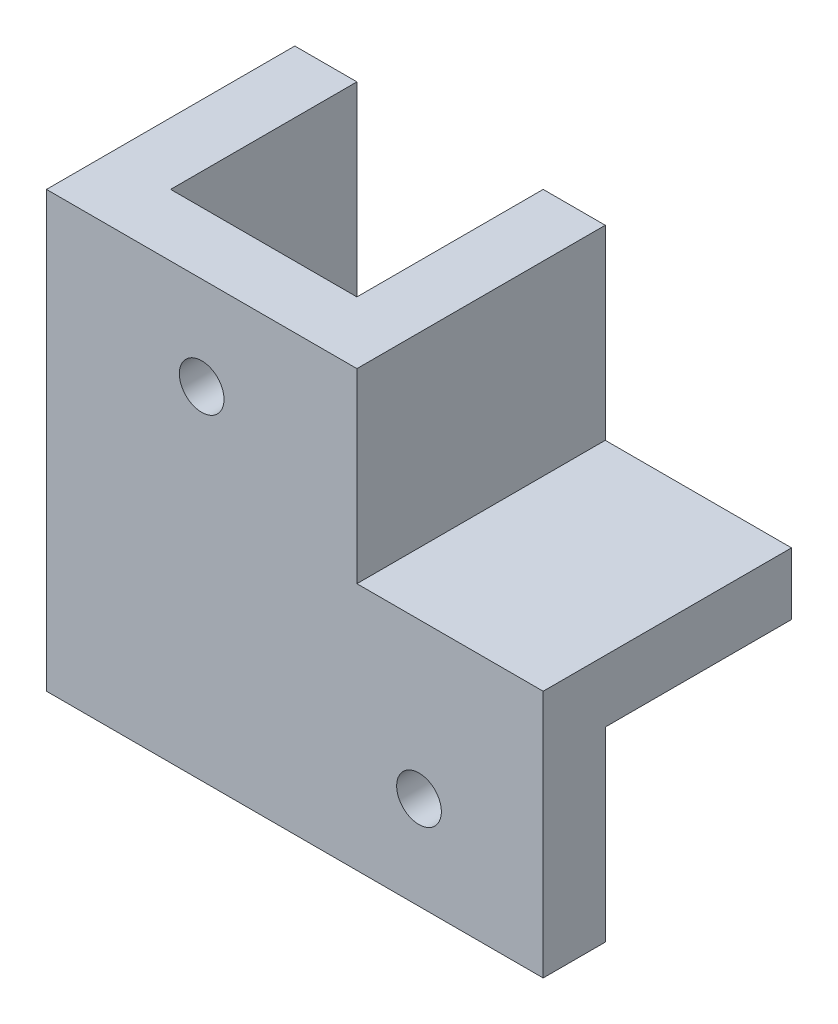
ISO-10303-21;
HEADER;
FILE_DESCRIPTION(('STEP AP214'),'2;1');
FILE_NAME('part.step','',(''),(''),'','','');
FILE_SCHEMA(('AUTOMOTIVE_DESIGN { 1 0 10303 214 1 1 1 1 }'));
ENDSEC;
DATA;
#1=APPLICATION_CONTEXT('core data for automotive mechanical design processes');
#2=APPLICATION_PROTOCOL_DEFINITION('international standard','automotive_design',2000,#1);
#3=PRODUCT_CONTEXT('',#1,'mechanical');
#4=PRODUCT('Part','Part','',(#3));
#5=PRODUCT_RELATED_PRODUCT_CATEGORY('part','',(#4));
#6=PRODUCT_DEFINITION_FORMATION('','',#4);
#7=PRODUCT_DEFINITION_CONTEXT('part definition',#1,'design');
#8=PRODUCT_DEFINITION('design','',#6,#7);
#9=PRODUCT_DEFINITION_SHAPE('','',#8);
#10=(LENGTH_UNIT() NAMED_UNIT(*) SI_UNIT(.MILLI.,.METRE.));
#11=(NAMED_UNIT(*) PLANE_ANGLE_UNIT() SI_UNIT($,.RADIAN.));
#12=(NAMED_UNIT(*) SI_UNIT($,.STERADIAN.) SOLID_ANGLE_UNIT());
#13=UNCERTAINTY_MEASURE_WITH_UNIT(LENGTH_MEASURE(1.E-05),#10,'distance_accuracy_value','');
#14=(GEOMETRIC_REPRESENTATION_CONTEXT(3) GLOBAL_UNCERTAINTY_ASSIGNED_CONTEXT((#13)) GLOBAL_UNIT_ASSIGNED_CONTEXT((#10,
#11,#12)) REPRESENTATION_CONTEXT('',''));
#15=CARTESIAN_POINT('',(0.,0.,0.));
#16=DIRECTION('',(0.,0.,1.));
#17=DIRECTION('',(1.,0.,0.));
#18=AXIS2_PLACEMENT_3D('',#15,#16,#17);
#19=CARTESIAN_POINT('',(7.47011952191236,-10.8067729083665,-15.));
#20=DIRECTION('',(1.,0.,0.));
#21=DIRECTION('',(0.,1.,0.));
#22=AXIS2_PLACEMENT_3D('',#19,#20,#21);
#23=PLANE('',#22);
#24=DIRECTION('',(0.,1.,0.));
#25=VECTOR('',#24,1.);
#26=CARTESIAN_POINT('',(7.47011952191236,9.19322709163348,0.));
#27=LINE('',#26,#25);
#28=CARTESIAN_POINT('',(7.47011952191236,-10.8067729083665,0.));
#29=VERTEX_POINT('',#28);
#30=CARTESIAN_POINT('',(7.47011952191236,9.19322709163348,0.));
#31=VERTEX_POINT('',#30);
#32=EDGE_CURVE('E164',#29,#31,#27,.T.);
#33=ORIENTED_EDGE('',*,*,#32,.T.);
#34=DIRECTION('',(0.,0.,1.));
#35=VECTOR('',#34,1.);
#36=CARTESIAN_POINT('',(7.47011952191236,9.19322709163348,-15.));
#37=LINE('',#36,#35);
#38=CARTESIAN_POINT('',(7.47011952191236,9.19322709163348,-15.));
#39=VERTEX_POINT('',#38);
#40=EDGE_CURVE('E11',#39,#31,#37,.T.);
#41=ORIENTED_EDGE('',*,*,#40,.F.);
#42=DIRECTION('',(0.,1.,0.));
#43=VECTOR('',#42,1.);
#44=CARTESIAN_POINT('',(7.47011952191236,-10.8067729083665,-15.));
#45=LINE('',#44,#43);
#46=CARTESIAN_POINT('',(7.47011952191236,-10.8067729083665,-15.));
#47=VERTEX_POINT('',#46);
#48=EDGE_CURVE('E182',#47,#39,#45,.T.);
#49=ORIENTED_EDGE('',*,*,#48,.F.);
#50=DIRECTION('',(0.,0.,1.));
#51=VECTOR('',#50,1.);
#52=CARTESIAN_POINT('',(7.47011952191236,-10.8067729083665,-15.));
#53=LINE('',#52,#51);
#54=EDGE_CURVE('E192',#47,#29,#53,.T.);
#55=ORIENTED_EDGE('',*,*,#54,.T.);
#56=EDGE_LOOP('',(#33,#41,#49,#55));
#57=FACE_BOUND('',#56,.T.);
#58=ADVANCED_FACE('F35',(#57),#23,.F.);
#59=CARTESIAN_POINT('',(27.4701195219124,-10.8067729083665,-15.));
#60=DIRECTION('',(0.,1.,0.));
#61=DIRECTION('',(-1.,0.,0.));
#62=AXIS2_PLACEMENT_3D('',#59,#60,#61);
#63=PLANE('',#62);
#64=DIRECTION('',(-1.,0.,0.));
#65=VECTOR('',#64,1.);
#66=CARTESIAN_POINT('',(27.4701195219124,-10.8067729083665,0.));
#67=LINE('',#66,#65);
#68=CARTESIAN_POINT('',(27.4701195219124,-10.8067729083665,0.));
#69=VERTEX_POINT('',#68);
#70=EDGE_CURVE('E161',#69,#29,#67,.T.);
#71=ORIENTED_EDGE('',*,*,#70,.T.);
#72=ORIENTED_EDGE('',*,*,#54,.F.);
#73=DIRECTION('',(-1.,0.,0.));
#74=VECTOR('',#73,1.);
#75=CARTESIAN_POINT('',(27.4701195219124,-10.8067729083665,-15.));
#76=LINE('',#75,#74);
#77=CARTESIAN_POINT('',(27.4701195219124,-10.8067729083665,-15.));
#78=VERTEX_POINT('',#77);
#79=EDGE_CURVE('E49',#78,#47,#76,.T.);
#80=ORIENTED_EDGE('',*,*,#79,.F.);
#81=DIRECTION('',(0.,0.,1.));
#82=VECTOR('',#81,1.);
#83=CARTESIAN_POINT('',(27.4701195219124,-10.8067729083665,-15.));
#84=LINE('',#83,#82);
#85=EDGE_CURVE('E195',#78,#69,#84,.T.);
#86=ORIENTED_EDGE('',*,*,#85,.T.);
#87=EDGE_LOOP('',(#71,#72,#80,#86));
#88=FACE_BOUND('',#87,.T.);
#89=ADVANCED_FACE('F225',(#88),#63,.F.);
#90=CARTESIAN_POINT('',(7.47011952191236,9.19322709163348,-15.));
#91=DIRECTION('',(0.,-1.,0.));
#92=DIRECTION('',(0.,0.,-1.));
#93=AXIS2_PLACEMENT_3D('',#90,#91,#92);
#94=PLANE('',#93);
#95=ORIENTED_EDGE('',*,*,#40,.T.);
#96=DIRECTION('',(-1.,0.,0.));
#97=VECTOR('',#96,1.);
#98=CARTESIAN_POINT('',(-7.52988047808764,9.19322709163348,0.));
#99=LINE('',#98,#97);
#100=CARTESIAN_POINT('',(-7.52988047808764,9.19322709163348,0.));
#101=VERTEX_POINT('',#100);
#102=EDGE_CURVE('E157',#31,#101,#99,.T.);
#103=ORIENTED_EDGE('',*,*,#102,.T.);
#104=DIRECTION('',(0.,0.,1.));
#105=VECTOR('',#104,1.);
#106=CARTESIAN_POINT('',(-7.52988047808764,9.19322709163348,-15.));
#107=LINE('',#106,#105);
#108=CARTESIAN_POINT('',(-7.52988047808764,9.19322709163348,-15.));
#109=VERTEX_POINT('',#108);
#110=EDGE_CURVE('E142',#109,#101,#107,.T.);
#111=ORIENTED_EDGE('',*,*,#110,.F.);
#112=DIRECTION('',(1.,0.,0.));
#113=VECTOR('',#112,1.);
#114=CARTESIAN_POINT('',(-7.52988047808764,9.19322709163348,-15.));
#115=LINE('',#114,#113);
#116=CARTESIAN_POINT('',(-12.5298804780876,9.19322709163348,-15.));
#117=VERTEX_POINT('',#116);
#118=EDGE_CURVE('E134',#117,#109,#115,.T.);
#119=ORIENTED_EDGE('',*,*,#118,.F.);
#120=DIRECTION('',(0.,0.,-1.));
#121=VECTOR('',#120,1.);
#122=CARTESIAN_POINT('',(-12.5298804780876,9.19322709163348,5.));
#123=LINE('',#122,#121);
#124=CARTESIAN_POINT('',(-12.5298804780876,9.19322709163348,5.));
#125=VERTEX_POINT('',#124);
#126=EDGE_CURVE('E145',#125,#117,#123,.T.);
#127=ORIENTED_EDGE('',*,*,#126,.F.);
#128=DIRECTION('',(-1.,0.,0.));
#129=VECTOR('',#128,1.);
#130=CARTESIAN_POINT('',(12.4701195219124,9.19322709163348,5.));
#131=LINE('',#130,#129);
#132=CARTESIAN_POINT('',(12.4701195219124,9.19322709163348,5.));
#133=VERTEX_POINT('',#132);
#134=EDGE_CURVE('E171',#133,#125,#131,.T.);
#135=ORIENTED_EDGE('',*,*,#134,.F.);
#136=DIRECTION('',(0.,0.,1.));
#137=VECTOR('',#136,1.);
#138=CARTESIAN_POINT('',(12.4701195219124,9.19322709163348,-15.));
#139=LINE('',#138,#137);
#140=CARTESIAN_POINT('',(12.4701195219124,9.19322709163348,-15.));
#141=VERTEX_POINT('',#140);
#142=EDGE_CURVE('E42',#141,#133,#139,.T.);
#143=ORIENTED_EDGE('',*,*,#142,.F.);
#144=DIRECTION('',(1.,0.,0.));
#145=VECTOR('',#144,1.);
#146=CARTESIAN_POINT('',(7.47011952191236,9.19322709163348,-15.));
#147=LINE('',#146,#145);
#148=EDGE_CURVE('E184',#39,#141,#147,.T.);
#149=ORIENTED_EDGE('',*,*,#148,.F.);
#150=EDGE_LOOP('',(#95,#103,#111,#119,#127,#135,#143,#149));
#151=FACE_BOUND('',#150,.T.);
#152=ADVANCED_FACE('F213',(#151),#94,.F.);
#153=CARTESIAN_POINT('',(12.4701195219124,9.19322709163348,-15.));
#154=DIRECTION('',(-1.,0.,0.));
#155=DIRECTION('',(0.,-1.,0.));
#156=AXIS2_PLACEMENT_3D('',#153,#154,#155);
#157=PLANE('',#156);
#158=ORIENTED_EDGE('',*,*,#142,.T.);
#159=DIRECTION('',(0.,1.,0.));
#160=VECTOR('',#159,1.);
#161=CARTESIAN_POINT('',(12.4701195219124,-5.80677290836653,5.));
#162=LINE('',#161,#160);
#163=CARTESIAN_POINT('',(12.4701195219124,-5.80677290836653,5.));
#164=VERTEX_POINT('',#163);
#165=EDGE_CURVE('E179',#164,#133,#162,.T.);
#166=ORIENTED_EDGE('',*,*,#165,.F.);
#167=DIRECTION('',(0.,0.,1.));
#168=VECTOR('',#167,1.);
#169=CARTESIAN_POINT('',(12.4701195219124,-5.80677290836653,-15.));
#170=LINE('',#169,#168);
#171=CARTESIAN_POINT('',(12.4701195219124,-5.80677290836653,-15.));
#172=VERTEX_POINT('',#171);
#173=EDGE_CURVE('E200',#172,#164,#170,.T.);
#174=ORIENTED_EDGE('',*,*,#173,.F.);
#175=DIRECTION('',(0.,-1.,0.));
#176=VECTOR('',#175,1.);
#177=CARTESIAN_POINT('',(12.4701195219124,9.19322709163348,-15.));
#178=LINE('',#177,#176);
#179=EDGE_CURVE('E186',#141,#172,#178,.T.);
#180=ORIENTED_EDGE('',*,*,#179,.F.);
#181=EDGE_LOOP('',(#158,#166,#174,#180));
#182=FACE_BOUND('',#181,.T.);
#183=ADVANCED_FACE('F205',(#182),#157,.F.);
#184=CARTESIAN_POINT('',(12.4701195219124,-5.80677290836653,-15.));
#185=DIRECTION('',(0.,-1.,0.));
#186=DIRECTION('',(1.,0.,0.));
#187=AXIS2_PLACEMENT_3D('',#184,#185,#186);
#188=PLANE('',#187);
#189=ORIENTED_EDGE('',*,*,#173,.T.);
#190=DIRECTION('',(-1.,0.,0.));
#191=VECTOR('',#190,1.);
#192=CARTESIAN_POINT('',(27.4701195219124,-5.80677290836653,5.));
#193=LINE('',#192,#191);
#194=CARTESIAN_POINT('',(27.4701195219124,-5.80677290836653,5.));
#195=VERTEX_POINT('',#194);
#196=EDGE_CURVE('E176',#195,#164,#193,.T.);
#197=ORIENTED_EDGE('',*,*,#196,.F.);
#198=DIRECTION('',(0.,0.,1.));
#199=VECTOR('',#198,1.);
#200=CARTESIAN_POINT('',(27.4701195219124,-5.80677290836653,-15.));
#201=LINE('',#200,#199);
#202=CARTESIAN_POINT('',(27.4701195219124,-5.80677290836653,-15.));
#203=VERTEX_POINT('',#202);
#204=EDGE_CURVE('E198',#203,#195,#201,.T.);
#205=ORIENTED_EDGE('',*,*,#204,.F.);
#206=DIRECTION('',(1.,0.,0.));
#207=VECTOR('',#206,1.);
#208=CARTESIAN_POINT('',(12.4701195219124,-5.80677290836653,-15.));
#209=LINE('',#208,#207);
#210=EDGE_CURVE('E188',#172,#203,#209,.T.);
#211=ORIENTED_EDGE('',*,*,#210,.F.);
#212=EDGE_LOOP('',(#189,#197,#205,#211));
#213=FACE_BOUND('',#212,.T.);
#214=ADVANCED_FACE('F229',(#213),#188,.F.);
#215=CARTESIAN_POINT('',(27.4701195219124,-10.8067729083665,-15.));
#216=DIRECTION('',(-1.,0.,0.));
#217=DIRECTION('',(0.,0.,1.));
#218=AXIS2_PLACEMENT_3D('',#215,#216,#217);
#219=PLANE('',#218);
#220=ORIENTED_EDGE('',*,*,#204,.T.);
#221=DIRECTION('',(0.,1.,0.));
#222=VECTOR('',#221,1.);
#223=CARTESIAN_POINT('',(27.4701195219124,-10.8067729083665,5.));
#224=LINE('',#223,#222);
#225=CARTESIAN_POINT('',(27.4701195219124,-25.8067729083665,5.));
#226=VERTEX_POINT('',#225);
#227=EDGE_CURVE('E173',#226,#195,#224,.T.);
#228=ORIENTED_EDGE('',*,*,#227,.F.);
#229=DIRECTION('',(0.,0.,-1.));
#230=VECTOR('',#229,1.);
#231=CARTESIAN_POINT('',(27.4701195219124,-25.8067729083665,5.));
#232=LINE('',#231,#230);
#233=CARTESIAN_POINT('',(27.4701195219124,-25.8067729083665,0.));
#234=VERTEX_POINT('',#233);
#235=EDGE_CURVE('E156',#226,#234,#232,.T.);
#236=ORIENTED_EDGE('',*,*,#235,.T.);
#237=DIRECTION('',(0.,1.,0.));
#238=VECTOR('',#237,1.);
#239=CARTESIAN_POINT('',(27.4701195219124,-25.8067729083665,0.));
#240=LINE('',#239,#238);
#241=EDGE_CURVE('E159',#234,#69,#240,.T.);
#242=ORIENTED_EDGE('',*,*,#241,.T.);
#243=ORIENTED_EDGE('',*,*,#85,.F.);
#244=DIRECTION('',(0.,-1.,0.));
#245=VECTOR('',#244,1.);
#246=CARTESIAN_POINT('',(27.4701195219124,-10.8067729083665,-15.));
#247=LINE('',#246,#245);
#248=EDGE_CURVE('E54',#203,#78,#247,.T.);
#249=ORIENTED_EDGE('',*,*,#248,.F.);
#250=EDGE_LOOP('',(#220,#228,#236,#242,#243,#249));
#251=FACE_BOUND('',#250,.T.);
#252=ADVANCED_FACE('F220',(#251),#219,.F.);
#253=CARTESIAN_POINT('',(0.,0.,-15.));
#254=DIRECTION('',(0.,0.,-1.));
#255=DIRECTION('',(-1.,0.,0.));
#256=AXIS2_PLACEMENT_3D('',#253,#254,#255);
#257=PLANE('',#256);
#258=ORIENTED_EDGE('',*,*,#48,.T.);
#259=ORIENTED_EDGE('',*,*,#148,.T.);
#260=ORIENTED_EDGE('',*,*,#179,.T.);
#261=ORIENTED_EDGE('',*,*,#210,.T.);
#262=ORIENTED_EDGE('',*,*,#248,.T.);
#263=ORIENTED_EDGE('',*,*,#79,.T.);
#264=EDGE_LOOP('',(#258,#259,#260,#261,#262,#263));
#265=FACE_BOUND('',#264,.T.);
#266=ADVANCED_FACE('F230',(#265),#257,.T.);
#267=CARTESIAN_POINT('',(0.,0.,5.));
#268=DIRECTION('',(0.,0.,1.));
#269=DIRECTION('',(1.,0.,0.));
#270=AXIS2_PLACEMENT_3D('',#267,#268,#269);
#271=PLANE('',#270);
#272=CARTESIAN_POINT('',(-0.0298804780876445,1.69322709163348,5.));
#273=DIRECTION('',(0.,0.,-1.));
#274=DIRECTION('',(-1.,0.,0.));
#275=AXIS2_PLACEMENT_3D('',#272,#273,#274);
#276=CIRCLE('',#275,1.8);
#277=CARTESIAN_POINT('',(-1.82988047808764,1.69322709163348,5.));
#278=VERTEX_POINT('',#277);
#279=EDGE_CURVE('E409',#278,#278,#276,.T.);
#280=ORIENTED_EDGE('',*,*,#279,.T.);
#281=EDGE_LOOP('',(#280));
#282=FACE_BOUND('',#281,.T.);
#283=CARTESIAN_POINT('',(17.4701195219124,-18.3067729083665,5.));
#284=DIRECTION('',(0.,0.,-1.));
#285=DIRECTION('',(-1.,0.,0.));
#286=AXIS2_PLACEMENT_3D('',#283,#284,#285);
#287=CIRCLE('',#286,1.8);
#288=CARTESIAN_POINT('',(15.6701195219124,-18.3067729083665,5.));
#289=VERTEX_POINT('',#288);
#290=EDGE_CURVE('E413',#289,#289,#287,.T.);
#291=ORIENTED_EDGE('',*,*,#290,.T.);
#292=EDGE_LOOP('',(#291));
#293=FACE_BOUND('',#292,.T.);
#294=DIRECTION('',(1.,0.,0.));
#295=VECTOR('',#294,1.);
#296=CARTESIAN_POINT('',(-7.52988047808764,-25.8067729083665,5.));
#297=LINE('',#296,#295);
#298=CARTESIAN_POINT('',(-12.5298804780876,-25.8067729083665,5.));
#299=VERTEX_POINT('',#298);
#300=EDGE_CURVE('E153',#299,#226,#297,.T.);
#301=ORIENTED_EDGE('',*,*,#300,.T.);
#302=ORIENTED_EDGE('',*,*,#227,.T.);
#303=ORIENTED_EDGE('',*,*,#196,.T.);
#304=ORIENTED_EDGE('',*,*,#165,.T.);
#305=ORIENTED_EDGE('',*,*,#134,.T.);
#306=DIRECTION('',(0.,-1.,0.));
#307=VECTOR('',#306,1.);
#308=CARTESIAN_POINT('',(-12.5298804780876,9.19322709163348,5.));
#309=LINE('',#308,#307);
#310=EDGE_CURVE('E141',#125,#299,#309,.T.);
#311=ORIENTED_EDGE('',*,*,#310,.T.);
#312=EDGE_LOOP('',(#301,#302,#303,#304,#305,#311));
#313=FACE_BOUND('',#312,.T.);
#314=ADVANCED_FACE('F210',(#282,#293,#313),#271,.T.);
#315=CARTESIAN_POINT('',(0.,0.,0.));
#316=DIRECTION('',(0.,0.,1.));
#317=DIRECTION('',(1.,0.,0.));
#318=AXIS2_PLACEMENT_3D('',#315,#316,#317);
#319=PLANE('',#318);
#320=CARTESIAN_POINT('',(-0.0298804780876445,1.69322709163348,0.));
#321=DIRECTION('',(0.,0.,-1.));
#322=DIRECTION('',(-1.,0.,0.));
#323=AXIS2_PLACEMENT_3D('',#320,#321,#322);
#324=CIRCLE('',#323,1.8);
#325=CARTESIAN_POINT('',(-1.82988047808764,1.69322709163348,0.));
#326=VERTEX_POINT('',#325);
#327=EDGE_CURVE('E412',#326,#326,#324,.T.);
#328=ORIENTED_EDGE('',*,*,#327,.F.);
#329=EDGE_LOOP('',(#328));
#330=FACE_BOUND('',#329,.T.);
#331=CARTESIAN_POINT('',(17.4701195219124,-18.3067729083665,0.));
#332=DIRECTION('',(0.,0.,-1.));
#333=DIRECTION('',(-1.,0.,0.));
#334=AXIS2_PLACEMENT_3D('',#331,#332,#333);
#335=CIRCLE('',#334,1.8);
#336=CARTESIAN_POINT('',(15.6701195219124,-18.3067729083665,0.));
#337=VERTEX_POINT('',#336);
#338=EDGE_CURVE('E417',#337,#337,#335,.T.);
#339=ORIENTED_EDGE('',*,*,#338,.F.);
#340=EDGE_LOOP('',(#339));
#341=FACE_BOUND('',#340,.T.);
#342=DIRECTION('',(0.,-1.,0.));
#343=VECTOR('',#342,1.);
#344=CARTESIAN_POINT('',(-7.52988047808764,-25.8067729083665,0.));
#345=LINE('',#344,#343);
#346=CARTESIAN_POINT('',(-7.52988047808764,-25.8067729083665,0.));
#347=VERTEX_POINT('',#346);
#348=EDGE_CURVE('E138',#101,#347,#345,.T.);
#349=ORIENTED_EDGE('',*,*,#348,.F.);
#350=ORIENTED_EDGE('',*,*,#102,.F.);
#351=ORIENTED_EDGE('',*,*,#32,.F.);
#352=ORIENTED_EDGE('',*,*,#70,.F.);
#353=ORIENTED_EDGE('',*,*,#241,.F.);
#354=DIRECTION('',(1.,0.,0.));
#355=VECTOR('',#354,1.);
#356=CARTESIAN_POINT('',(-7.52988047808764,-25.8067729083665,0.));
#357=LINE('',#356,#355);
#358=EDGE_CURVE('E152',#347,#234,#357,.T.);
#359=ORIENTED_EDGE('',*,*,#358,.F.);
#360=EDGE_LOOP('',(#349,#350,#351,#352,#353,#359));
#361=FACE_BOUND('',#360,.T.);
#362=ADVANCED_FACE('F223',(#330,#341,#361),#319,.F.);
#363=CARTESIAN_POINT('',(-7.52988047808764,-25.8067729083665,5.));
#364=DIRECTION('',(0.,1.,0.));
#365=DIRECTION('',(0.,0.,1.));
#366=AXIS2_PLACEMENT_3D('',#363,#364,#365);
#367=PLANE('',#366);
#368=DIRECTION('',(0.,0.,-1.));
#369=VECTOR('',#368,1.);
#370=CARTESIAN_POINT('',(-12.5298804780876,-25.8067729083665,5.));
#371=LINE('',#370,#369);
#372=CARTESIAN_POINT('',(-12.5298804780876,-25.8067729083665,-15.));
#373=VERTEX_POINT('',#372);
#374=EDGE_CURVE('E124',#299,#373,#371,.T.);
#375=ORIENTED_EDGE('',*,*,#374,.T.);
#376=DIRECTION('',(-1.,0.,0.));
#377=VECTOR('',#376,1.);
#378=CARTESIAN_POINT('',(-7.52988047808764,-25.8067729083665,-15.));
#379=LINE('',#378,#377);
#380=CARTESIAN_POINT('',(-7.52988047808764,-25.8067729083665,-15.));
#381=VERTEX_POINT('',#380);
#382=EDGE_CURVE('E117',#381,#373,#379,.T.);
#383=ORIENTED_EDGE('',*,*,#382,.F.);
#384=DIRECTION('',(0.,0.,1.));
#385=VECTOR('',#384,1.);
#386=CARTESIAN_POINT('',(-7.52988047808764,-25.8067729083665,-15.));
#387=LINE('',#386,#385);
#388=EDGE_CURVE('E121',#381,#347,#387,.T.);
#389=ORIENTED_EDGE('',*,*,#388,.T.);
#390=ORIENTED_EDGE('',*,*,#358,.T.);
#391=ORIENTED_EDGE('',*,*,#235,.F.);
#392=ORIENTED_EDGE('',*,*,#300,.F.);
#393=EDGE_LOOP('',(#375,#383,#389,#390,#391,#392));
#394=FACE_BOUND('',#393,.T.);
#395=ADVANCED_FACE('F119',(#394),#367,.F.);
#396=CARTESIAN_POINT('',(-12.5298804780876,9.19322709163348,5.));
#397=DIRECTION('',(1.,0.,0.));
#398=DIRECTION('',(0.,1.,0.));
#399=AXIS2_PLACEMENT_3D('',#396,#397,#398);
#400=PLANE('',#399);
#401=ORIENTED_EDGE('',*,*,#126,.T.);
#402=DIRECTION('',(0.,1.,0.));
#403=VECTOR('',#402,1.);
#404=CARTESIAN_POINT('',(-12.5298804780876,-25.8067729083665,-15.));
#405=LINE('',#404,#403);
#406=EDGE_CURVE('E128',#373,#117,#405,.T.);
#407=ORIENTED_EDGE('',*,*,#406,.F.);
#408=ORIENTED_EDGE('',*,*,#374,.F.);
#409=ORIENTED_EDGE('',*,*,#310,.F.);
#410=EDGE_LOOP('',(#401,#407,#408,#409));
#411=FACE_BOUND('',#410,.T.);
#412=ADVANCED_FACE('F216',(#411),#400,.F.);
#413=CARTESIAN_POINT('',(-7.52988047808764,-25.8067729083665,-15.));
#414=DIRECTION('',(-1.,0.,0.));
#415=DIRECTION('',(0.,-1.,0.));
#416=AXIS2_PLACEMENT_3D('',#413,#414,#415);
#417=PLANE('',#416);
#418=ORIENTED_EDGE('',*,*,#348,.T.);
#419=ORIENTED_EDGE('',*,*,#388,.F.);
#420=DIRECTION('',(0.,-1.,0.));
#421=VECTOR('',#420,1.);
#422=CARTESIAN_POINT('',(-7.52988047808764,-25.8067729083665,-15.));
#423=LINE('',#422,#421);
#424=EDGE_CURVE('E129',#109,#381,#423,.T.);
#425=ORIENTED_EDGE('',*,*,#424,.F.);
#426=ORIENTED_EDGE('',*,*,#110,.T.);
#427=EDGE_LOOP('',(#418,#419,#425,#426));
#428=FACE_BOUND('',#427,.T.);
#429=ADVANCED_FACE('F140',(#428),#417,.F.);
#430=CARTESIAN_POINT('',(0.,0.,-15.));
#431=DIRECTION('',(0.,0.,1.));
#432=DIRECTION('',(1.,0.,0.));
#433=AXIS2_PLACEMENT_3D('',#430,#431,#432);
#434=PLANE('',#433);
#435=ORIENTED_EDGE('',*,*,#424,.T.);
#436=ORIENTED_EDGE('',*,*,#382,.T.);
#437=ORIENTED_EDGE('',*,*,#406,.T.);
#438=ORIENTED_EDGE('',*,*,#118,.T.);
#439=EDGE_LOOP('',(#435,#436,#437,#438));
#440=FACE_BOUND('',#439,.T.);
#441=ADVANCED_FACE('F132',(#440),#434,.F.);
#442=CARTESIAN_POINT('',(17.4701195219124,-18.3067729083665,5.));
#443=DIRECTION('',(0.,0.,-1.));
#444=DIRECTION('',(-1.,0.,0.));
#445=AXIS2_PLACEMENT_3D('',#442,#443,#444);
#446=CYLINDRICAL_SURFACE('',#445,1.8);
#447=ORIENTED_EDGE('',*,*,#290,.F.);
#448=EDGE_LOOP('',(#447));
#449=FACE_BOUND('',#448,.T.);
#450=ORIENTED_EDGE('',*,*,#338,.T.);
#451=EDGE_LOOP('',(#450));
#452=FACE_BOUND('',#451,.T.);
#453=ADVANCED_FACE('F305',(#449,#452),#446,.F.);
#454=CARTESIAN_POINT('',(-0.0298804780876445,1.69322709163348,5.));
#455=DIRECTION('',(0.,0.,-1.));
#456=DIRECTION('',(-1.,0.,0.));
#457=AXIS2_PLACEMENT_3D('',#454,#455,#456);
#458=CYLINDRICAL_SURFACE('',#457,1.8);
#459=ORIENTED_EDGE('',*,*,#279,.F.);
#460=EDGE_LOOP('',(#459));
#461=FACE_BOUND('',#460,.T.);
#462=ORIENTED_EDGE('',*,*,#327,.T.);
#463=EDGE_LOOP('',(#462));
#464=FACE_BOUND('',#463,.T.);
#465=ADVANCED_FACE('F311',(#461,#464),#458,.F.);
#466=CLOSED_SHELL('',(#58,#89,#152,#183,#214,#252,#266,#314,#362,#395,#412,#429,#441,#453,#465));
#467=MANIFOLD_SOLID_BREP('B2',#466);
#468=ADVANCED_BREP_SHAPE_REPRESENTATION('',(#18,#467),#14);
#469=SHAPE_DEFINITION_REPRESENTATION(#9,#468);
ENDSEC;
END-ISO-10303-21;
